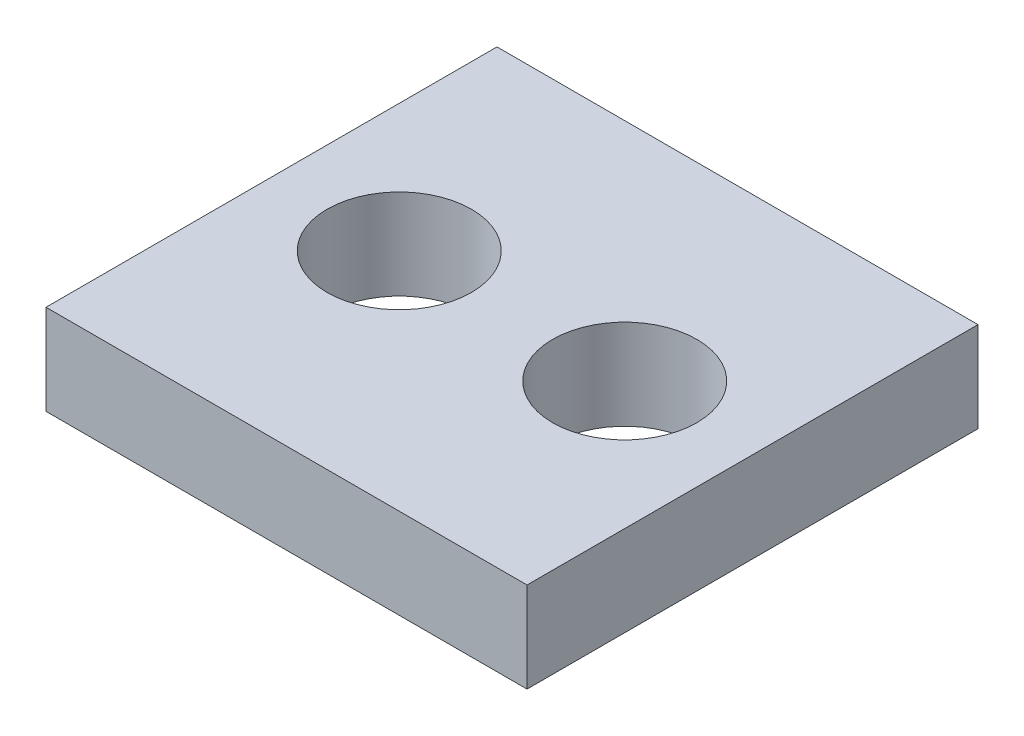
ISO-10303-21;
HEADER;
FILE_DESCRIPTION(('STEP AP214'),'2;1');
FILE_NAME('part.step','',(''),(''),'','','');
FILE_SCHEMA(('AUTOMOTIVE_DESIGN { 1 0 10303 214 1 1 1 1 }'));
ENDSEC;
DATA;
#1=APPLICATION_CONTEXT('core data for automotive mechanical design processes');
#2=APPLICATION_PROTOCOL_DEFINITION('international standard','automotive_design',2000,#1);
#3=PRODUCT_CONTEXT('',#1,'mechanical');
#4=PRODUCT('Part','Part','',(#3));
#5=PRODUCT_RELATED_PRODUCT_CATEGORY('part','',(#4));
#6=PRODUCT_DEFINITION_FORMATION('','',#4);
#7=PRODUCT_DEFINITION_CONTEXT('part definition',#1,'design');
#8=PRODUCT_DEFINITION('design','',#6,#7);
#9=PRODUCT_DEFINITION_SHAPE('','',#8);
#10=(LENGTH_UNIT() NAMED_UNIT(*) SI_UNIT(.MILLI.,.METRE.));
#11=(NAMED_UNIT(*) PLANE_ANGLE_UNIT() SI_UNIT($,.RADIAN.));
#12=(NAMED_UNIT(*) SI_UNIT($,.STERADIAN.) SOLID_ANGLE_UNIT());
#13=UNCERTAINTY_MEASURE_WITH_UNIT(LENGTH_MEASURE(1.E-05),#10,'distance_accuracy_value','');
#14=(GEOMETRIC_REPRESENTATION_CONTEXT(3) GLOBAL_UNCERTAINTY_ASSIGNED_CONTEXT((#13)) GLOBAL_UNIT_ASSIGNED_CONTEXT((#10,
#11,#12)) REPRESENTATION_CONTEXT('',''));
#15=CARTESIAN_POINT('',(0.,0.,0.));
#16=DIRECTION('',(0.,0.,1.));
#17=DIRECTION('',(1.,0.,0.));
#18=AXIS2_PLACEMENT_3D('',#15,#16,#17);
#19=CARTESIAN_POINT('',(8.,3.,7.5));
#20=DIRECTION('',(-1.,0.,0.));
#21=DIRECTION('',(0.,0.,1.));
#22=AXIS2_PLACEMENT_3D('',#19,#20,#21);
#23=PLANE('',#22);
#24=DIRECTION('',(0.,0.,-1.));
#25=VECTOR('',#24,1.);
#26=CARTESIAN_POINT('',(8.,0.,7.5));
#27=LINE('',#26,#25);
#28=CARTESIAN_POINT('',(8.,0.,7.5));
#29=VERTEX_POINT('',#28);
#30=CARTESIAN_POINT('',(8.,0.,-7.5));
#31=VERTEX_POINT('',#30);
#32=EDGE_CURVE('E96',#29,#31,#27,.T.);
#33=ORIENTED_EDGE('',*,*,#32,.T.);
#34=DIRECTION('',(0.,-1.,0.));
#35=VECTOR('',#34,1.);
#36=CARTESIAN_POINT('',(8.,3.,-7.5));
#37=LINE('',#36,#35);
#38=CARTESIAN_POINT('',(8.,3.,-7.5));
#39=VERTEX_POINT('',#38);
#40=EDGE_CURVE('E11',#39,#31,#37,.T.);
#41=ORIENTED_EDGE('',*,*,#40,.F.);
#42=DIRECTION('',(0.,0.,-1.));
#43=VECTOR('',#42,1.);
#44=CARTESIAN_POINT('',(8.,3.,7.5));
#45=LINE('',#44,#43);
#46=CARTESIAN_POINT('',(8.,3.,7.5));
#47=VERTEX_POINT('',#46);
#48=EDGE_CURVE('E84',#47,#39,#45,.T.);
#49=ORIENTED_EDGE('',*,*,#48,.F.);
#50=DIRECTION('',(0.,-1.,0.));
#51=VECTOR('',#50,1.);
#52=CARTESIAN_POINT('',(8.,3.,7.5));
#53=LINE('',#52,#51);
#54=EDGE_CURVE('E92',#47,#29,#53,.T.);
#55=ORIENTED_EDGE('',*,*,#54,.T.);
#56=EDGE_LOOP('',(#33,#41,#49,#55));
#57=FACE_BOUND('',#56,.T.);
#58=ADVANCED_FACE('F33',(#57),#23,.F.);
#59=CARTESIAN_POINT('',(-8.,3.,-7.5));
#60=DIRECTION('',(0.,0.,1.));
#61=DIRECTION('',(1.,0.,0.));
#62=AXIS2_PLACEMENT_3D('',#59,#60,#61);
#63=PLANE('',#62);
#64=DIRECTION('',(-1.,0.,0.));
#65=VECTOR('',#64,1.);
#66=CARTESIAN_POINT('',(-8.,0.,-7.5));
#67=LINE('',#66,#65);
#68=CARTESIAN_POINT('',(-8.,0.,-7.5));
#69=VERTEX_POINT('',#68);
#70=EDGE_CURVE('E88',#31,#69,#67,.T.);
#71=ORIENTED_EDGE('',*,*,#70,.T.);
#72=DIRECTION('',(0.,-1.,0.));
#73=VECTOR('',#72,1.);
#74=CARTESIAN_POINT('',(-8.,3.,-7.5));
#75=LINE('',#74,#73);
#76=CARTESIAN_POINT('',(-8.,3.,-7.5));
#77=VERTEX_POINT('',#76);
#78=EDGE_CURVE('E41',#77,#69,#75,.T.);
#79=ORIENTED_EDGE('',*,*,#78,.F.);
#80=DIRECTION('',(-1.,0.,0.));
#81=VECTOR('',#80,1.);
#82=CARTESIAN_POINT('',(-8.,3.,-7.5));
#83=LINE('',#82,#81);
#84=EDGE_CURVE('E79',#39,#77,#83,.T.);
#85=ORIENTED_EDGE('',*,*,#84,.F.);
#86=ORIENTED_EDGE('',*,*,#40,.T.);
#87=EDGE_LOOP('',(#71,#79,#85,#86));
#88=FACE_BOUND('',#87,.T.);
#89=ADVANCED_FACE('F87',(#88),#63,.F.);
#90=CARTESIAN_POINT('',(-8.,3.,7.5));
#91=DIRECTION('',(1.,0.,0.));
#92=DIRECTION('',(0.,0.,-1.));
#93=AXIS2_PLACEMENT_3D('',#90,#91,#92);
#94=PLANE('',#93);
#95=DIRECTION('',(0.,0.,1.));
#96=VECTOR('',#95,1.);
#97=CARTESIAN_POINT('',(-8.,0.,7.5));
#98=LINE('',#97,#96);
#99=CARTESIAN_POINT('',(-8.,0.,7.5));
#100=VERTEX_POINT('',#99);
#101=EDGE_CURVE('E66',#69,#100,#98,.T.);
#102=ORIENTED_EDGE('',*,*,#101,.T.);
#103=DIRECTION('',(0.,-1.,0.));
#104=VECTOR('',#103,1.);
#105=CARTESIAN_POINT('',(-8.,3.,7.5));
#106=LINE('',#105,#104);
#107=CARTESIAN_POINT('',(-8.,3.,7.5));
#108=VERTEX_POINT('',#107);
#109=EDGE_CURVE('E89',#108,#100,#106,.T.);
#110=ORIENTED_EDGE('',*,*,#109,.F.);
#111=DIRECTION('',(0.,0.,1.));
#112=VECTOR('',#111,1.);
#113=CARTESIAN_POINT('',(-8.,3.,7.5));
#114=LINE('',#113,#112);
#115=EDGE_CURVE('E82',#77,#108,#114,.T.);
#116=ORIENTED_EDGE('',*,*,#115,.F.);
#117=ORIENTED_EDGE('',*,*,#78,.T.);
#118=EDGE_LOOP('',(#102,#110,#116,#117));
#119=FACE_BOUND('',#118,.T.);
#120=ADVANCED_FACE('F90',(#119),#94,.F.);
#121=CARTESIAN_POINT('',(-8.,3.,7.5));
#122=DIRECTION('',(0.,0.,-1.));
#123=DIRECTION('',(-1.,0.,0.));
#124=AXIS2_PLACEMENT_3D('',#121,#122,#123);
#125=PLANE('',#124);
#126=DIRECTION('',(1.,0.,0.));
#127=VECTOR('',#126,1.);
#128=CARTESIAN_POINT('',(-8.,0.,7.5));
#129=LINE('',#128,#127);
#130=EDGE_CURVE('E72',#100,#29,#129,.T.);
#131=ORIENTED_EDGE('',*,*,#130,.T.);
#132=ORIENTED_EDGE('',*,*,#54,.F.);
#133=DIRECTION('',(1.,0.,0.));
#134=VECTOR('',#133,1.);
#135=CARTESIAN_POINT('',(-8.,3.,7.5));
#136=LINE('',#135,#134);
#137=EDGE_CURVE('E49',#108,#47,#136,.T.);
#138=ORIENTED_EDGE('',*,*,#137,.F.);
#139=ORIENTED_EDGE('',*,*,#109,.T.);
#140=EDGE_LOOP('',(#131,#132,#138,#139));
#141=FACE_BOUND('',#140,.T.);
#142=ADVANCED_FACE('F104',(#141),#125,.F.);
#143=CARTESIAN_POINT('',(0.,3.,0.));
#144=DIRECTION('',(0.,-1.,0.));
#145=DIRECTION('',(0.,0.,-1.));
#146=AXIS2_PLACEMENT_3D('',#143,#144,#145);
#147=PLANE('',#146);
#148=CARTESIAN_POINT('',(3.75,3.,0.));
#149=DIRECTION('',(0.,-1.,0.));
#150=DIRECTION('',(0.,0.,-1.));
#151=AXIS2_PLACEMENT_3D('',#148,#149,#150);
#152=CIRCLE('',#151,2.4);
#153=CARTESIAN_POINT('',(3.75,3.,-2.4));
#154=VERTEX_POINT('',#153);
#155=EDGE_CURVE('E115',#154,#154,#152,.F.);
#156=ORIENTED_EDGE('',*,*,#155,.F.);
#157=EDGE_LOOP('',(#156));
#158=FACE_BOUND('',#157,.T.);
#159=CARTESIAN_POINT('',(-3.75,3.,0.));
#160=DIRECTION('',(0.,-1.,0.));
#161=DIRECTION('',(0.,0.,-1.));
#162=AXIS2_PLACEMENT_3D('',#159,#160,#161);
#163=CIRCLE('',#162,2.4);
#164=CARTESIAN_POINT('',(-3.75,3.,-2.4));
#165=VERTEX_POINT('',#164);
#166=EDGE_CURVE('E99',#165,#165,#163,.T.);
#167=ORIENTED_EDGE('',*,*,#166,.T.);
#168=EDGE_LOOP('',(#167));
#169=FACE_BOUND('',#168,.T.);
#170=ORIENTED_EDGE('',*,*,#48,.T.);
#171=ORIENTED_EDGE('',*,*,#84,.T.);
#172=ORIENTED_EDGE('',*,*,#115,.T.);
#173=ORIENTED_EDGE('',*,*,#137,.T.);
#174=EDGE_LOOP('',(#170,#171,#172,#173));
#175=FACE_BOUND('',#174,.T.);
#176=ADVANCED_FACE('F80',(#158,#169,#175),#147,.F.);
#177=CARTESIAN_POINT('',(0.,0.,0.));
#178=DIRECTION('',(0.,-1.,0.));
#179=DIRECTION('',(0.,0.,-1.));
#180=AXIS2_PLACEMENT_3D('',#177,#178,#179);
#181=PLANE('',#180);
#182=CARTESIAN_POINT('',(3.75,0.,0.));
#183=DIRECTION('',(0.,-1.,0.));
#184=DIRECTION('',(0.,0.,1.));
#185=AXIS2_PLACEMENT_3D('',#182,#183,#184);
#186=CIRCLE('',#185,2.4);
#187=CARTESIAN_POINT('',(3.75,0.,2.4));
#188=VERTEX_POINT('',#187);
#189=EDGE_CURVE('E118',#188,#188,#186,.T.);
#190=ORIENTED_EDGE('',*,*,#189,.F.);
#191=EDGE_LOOP('',(#190));
#192=FACE_BOUND('',#191,.T.);
#193=CARTESIAN_POINT('',(-3.75,0.,0.));
#194=DIRECTION('',(0.,1.,0.));
#195=DIRECTION('',(0.,0.,1.));
#196=AXIS2_PLACEMENT_3D('',#193,#194,#195);
#197=CIRCLE('',#196,2.4);
#198=CARTESIAN_POINT('',(-3.75,0.,2.4));
#199=VERTEX_POINT('',#198);
#200=EDGE_CURVE('E112',#199,#199,#197,.T.);
#201=ORIENTED_EDGE('',*,*,#200,.T.);
#202=EDGE_LOOP('',(#201));
#203=FACE_BOUND('',#202,.T.);
#204=ORIENTED_EDGE('',*,*,#32,.F.);
#205=ORIENTED_EDGE('',*,*,#130,.F.);
#206=ORIENTED_EDGE('',*,*,#101,.F.);
#207=ORIENTED_EDGE('',*,*,#70,.F.);
#208=EDGE_LOOP('',(#204,#205,#206,#207));
#209=FACE_BOUND('',#208,.T.);
#210=ADVANCED_FACE('F107',(#192,#203,#209),#181,.T.);
#211=CARTESIAN_POINT('',(-3.75,0.,0.));
#212=DIRECTION('',(0.,1.,0.));
#213=DIRECTION('',(0.,0.,1.));
#214=AXIS2_PLACEMENT_3D('',#211,#212,#213);
#215=CYLINDRICAL_SURFACE('',#214,2.4);
#216=ORIENTED_EDGE('',*,*,#200,.F.);
#217=EDGE_LOOP('',(#216));
#218=FACE_BOUND('',#217,.T.);
#219=ORIENTED_EDGE('',*,*,#166,.F.);
#220=EDGE_LOOP('',(#219));
#221=FACE_BOUND('',#220,.T.);
#222=ADVANCED_FACE('F127',(#218,#221),#215,.F.);
#223=CARTESIAN_POINT('',(3.75,0.,0.));
#224=DIRECTION('',(0.,1.,0.));
#225=DIRECTION('',(0.,0.,1.));
#226=AXIS2_PLACEMENT_3D('',#223,#224,#225);
#227=CYLINDRICAL_SURFACE('',#226,2.4);
#228=ORIENTED_EDGE('',*,*,#189,.T.);
#229=EDGE_LOOP('',(#228));
#230=FACE_BOUND('',#229,.T.);
#231=ORIENTED_EDGE('',*,*,#155,.T.);
#232=EDGE_LOOP('',(#231));
#233=FACE_BOUND('',#232,.T.);
#234=ADVANCED_FACE('F122',(#230,#233),#227,.F.);
#235=CLOSED_SHELL('',(#58,#89,#120,#142,#176,#210,#222,#234));
#236=MANIFOLD_SOLID_BREP('B2',#235);
#237=ADVANCED_BREP_SHAPE_REPRESENTATION('',(#18,#236),#14);
#238=SHAPE_DEFINITION_REPRESENTATION(#9,#237);
ENDSEC;
END-ISO-10303-21;
